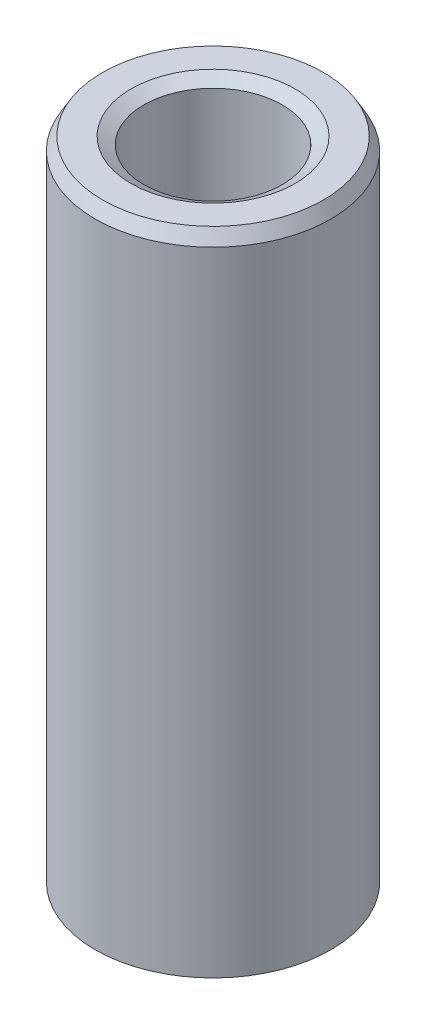
ISO-10303-21;
HEADER;
FILE_DESCRIPTION(('STEP AP214'),'2;1');
FILE_NAME('part.step','',(''),(''),'','','');
FILE_SCHEMA(('AUTOMOTIVE_DESIGN { 1 0 10303 214 1 1 1 1 }'));
ENDSEC;
DATA;
#1=APPLICATION_CONTEXT('core data for automotive mechanical design processes');
#2=APPLICATION_PROTOCOL_DEFINITION('international standard','automotive_design',2000,#1);
#3=PRODUCT_CONTEXT('',#1,'mechanical');
#4=PRODUCT('Part','Part','',(#3));
#5=PRODUCT_RELATED_PRODUCT_CATEGORY('part','',(#4));
#6=PRODUCT_DEFINITION_FORMATION('','',#4);
#7=PRODUCT_DEFINITION_CONTEXT('part definition',#1,'design');
#8=PRODUCT_DEFINITION('design','',#6,#7);
#9=PRODUCT_DEFINITION_SHAPE('','',#8);
#10=(LENGTH_UNIT() NAMED_UNIT(*) SI_UNIT(.MILLI.,.METRE.));
#11=(NAMED_UNIT(*) PLANE_ANGLE_UNIT() SI_UNIT($,.RADIAN.));
#12=(NAMED_UNIT(*) SI_UNIT($,.STERADIAN.) SOLID_ANGLE_UNIT());
#13=UNCERTAINTY_MEASURE_WITH_UNIT(LENGTH_MEASURE(1.E-05),#10,'distance_accuracy_value','');
#14=(GEOMETRIC_REPRESENTATION_CONTEXT(3) GLOBAL_UNCERTAINTY_ASSIGNED_CONTEXT((#13)) GLOBAL_UNIT_ASSIGNED_CONTEXT((#10,
#11,#12)) REPRESENTATION_CONTEXT('',''));
#15=CARTESIAN_POINT('',(0.,0.,0.));
#16=DIRECTION('',(0.,0.,1.));
#17=DIRECTION('',(1.,0.,0.));
#18=AXIS2_PLACEMENT_3D('',#15,#16,#17);
#19=CARTESIAN_POINT('',(0.,124.653891143306,0.));
#20=DIRECTION('',(0.,-1.,0.));
#21=DIRECTION('',(0.,0.,-1.));
#22=AXIS2_PLACEMENT_3D('',#19,#20,#21);
#23=CYLINDRICAL_SURFACE('',#22,22.5);
#24=CARTESIAN_POINT('',(0.,1.41458466481735,0.));
#25=DIRECTION('',(0.,1.,0.));
#26=DIRECTION('',(0.,0.,1.));
#27=AXIS2_PLACEMENT_3D('',#24,#25,#26);
#28=CIRCLE('',#27,22.5);
#29=CARTESIAN_POINT('',(0.,1.41458466481735,22.5));
#30=VERTEX_POINT('',#29);
#31=EDGE_CURVE('E10',#30,#30,#28,.T.);
#32=ORIENTED_EDGE('',*,*,#31,.T.);
#33=EDGE_LOOP('',(#32));
#34=FACE_BOUND('',#33,.T.);
#35=CARTESIAN_POINT('',(0.,122.203758632235,0.));
#36=DIRECTION('',(0.,1.,0.));
#37=DIRECTION('',(0.,0.,1.));
#38=AXIS2_PLACEMENT_3D('',#35,#36,#37);
#39=CIRCLE('',#38,22.5);
#40=CARTESIAN_POINT('',(0.,122.203758632235,22.5));
#41=VERTEX_POINT('',#40);
#42=EDGE_CURVE('E50',#41,#41,#39,.F.);
#43=ORIENTED_EDGE('',*,*,#42,.T.);
#44=EDGE_LOOP('',(#43));
#45=FACE_BOUND('',#44,.T.);
#46=ADVANCED_FACE('F39',(#34,#45),#23,.T.);
#47=CARTESIAN_POINT('',(0.,124.653891143306,0.));
#48=DIRECTION('',(0.,1.,0.));
#49=DIRECTION('',(0.,0.,1.));
#50=AXIS2_PLACEMENT_3D('',#47,#48,#49);
#51=PLANE('',#50);
#52=CARTESIAN_POINT('',(0.,124.653891143306,0.));
#53=DIRECTION('',(0.,1.,0.));
#54=DIRECTION('',(0.,0.,1.));
#55=AXIS2_PLACEMENT_3D('',#52,#53,#54);
#56=CIRCLE('',#55,15.6585667691788);
#57=CARTESIAN_POINT('',(0.,124.653891143306,15.6585667691788));
#58=VERTEX_POINT('',#57);
#59=EDGE_CURVE('E58',#58,#58,#56,.F.);
#60=ORIENTED_EDGE('',*,*,#59,.T.);
#61=EDGE_LOOP('',(#60));
#62=FACE_BOUND('',#61,.T.);
#63=CARTESIAN_POINT('',(0.,124.653891143306,0.));
#64=DIRECTION('',(0.,1.,0.));
#65=DIRECTION('',(0.,0.,1.));
#66=AXIS2_PLACEMENT_3D('',#63,#64,#65);
#67=CIRCLE('',#66,21.0854153351826);
#68=CARTESIAN_POINT('',(0.,124.653891143306,21.0854153351826));
#69=VERTEX_POINT('',#68);
#70=EDGE_CURVE('E61',#69,#69,#67,.T.);
#71=ORIENTED_EDGE('',*,*,#70,.T.);
#72=EDGE_LOOP('',(#71));
#73=FACE_BOUND('',#72,.T.);
#74=ADVANCED_FACE('F88',(#62,#73),#51,.T.);
#75=CARTESIAN_POINT('',(0.,0.,0.));
#76=DIRECTION('',(0.,1.,0.));
#77=DIRECTION('',(0.,0.,1.));
#78=AXIS2_PLACEMENT_3D('',#75,#76,#77);
#79=PLANE('',#78);
#80=CARTESIAN_POINT('',(0.,0.,0.));
#81=DIRECTION('',(0.,1.,0.));
#82=DIRECTION('',(0.,0.,1.));
#83=AXIS2_PLACEMENT_3D('',#80,#81,#82);
#84=CIRCLE('',#83,14.6230189229246);
#85=CARTESIAN_POINT('',(0.,0.,14.6230189229246));
#86=VERTEX_POINT('',#85);
#87=EDGE_CURVE('E51',#86,#86,#84,.T.);
#88=ORIENTED_EDGE('',*,*,#87,.T.);
#89=EDGE_LOOP('',(#88));
#90=FACE_BOUND('',#89,.T.);
#91=CARTESIAN_POINT('',(0.,0.,0.));
#92=DIRECTION('',(0.,1.,0.));
#93=DIRECTION('',(0.,0.,1.));
#94=AXIS2_PLACEMENT_3D('',#91,#92,#93);
#95=CIRCLE('',#94,20.0498674889285);
#96=CARTESIAN_POINT('',(0.,0.,20.0498674889285));
#97=VERTEX_POINT('',#96);
#98=EDGE_CURVE('E54',#97,#97,#95,.F.);
#99=ORIENTED_EDGE('',*,*,#98,.T.);
#100=EDGE_LOOP('',(#99));
#101=FACE_BOUND('',#100,.T.);
#102=ADVANCED_FACE('F83',(#90,#101),#79,.F.);
#103=CARTESIAN_POINT('',(0.,124.653891143306,0.));
#104=DIRECTION('',(0.,-1.,0.));
#105=DIRECTION('',(0.,0.,-1.));
#106=AXIS2_PLACEMENT_3D('',#103,#104,#105);
#107=CYLINDRICAL_SURFACE('',#106,13.2084342581073);
#108=CARTESIAN_POINT('',(0.,123.239306478489,0.));
#109=DIRECTION('',(0.,1.,0.));
#110=DIRECTION('',(0.,0.,1.));
#111=AXIS2_PLACEMENT_3D('',#108,#109,#110);
#112=CIRCLE('',#111,13.2084342581073);
#113=CARTESIAN_POINT('',(0.,123.239306478489,13.2084342581073));
#114=VERTEX_POINT('',#113);
#115=EDGE_CURVE('E67',#114,#114,#112,.T.);
#116=ORIENTED_EDGE('',*,*,#115,.T.);
#117=EDGE_LOOP('',(#116));
#118=FACE_BOUND('',#117,.T.);
#119=CARTESIAN_POINT('',(0.,2.45013251107146,0.));
#120=DIRECTION('',(0.,1.,0.));
#121=DIRECTION('',(0.,0.,1.));
#122=AXIS2_PLACEMENT_3D('',#119,#120,#121);
#123=CIRCLE('',#122,13.2084342581073);
#124=CARTESIAN_POINT('',(0.,2.45013251107146,13.2084342581073));
#125=VERTEX_POINT('',#124);
#126=EDGE_CURVE('E69',#125,#125,#123,.F.);
#127=ORIENTED_EDGE('',*,*,#126,.T.);
#128=EDGE_LOOP('',(#127));
#129=FACE_BOUND('',#128,.T.);
#130=ADVANCED_FACE('F71',(#118,#129),#107,.F.);
#131=CARTESIAN_POINT('',(0.,123.239306478489,0.));
#132=DIRECTION('',(0.,1.,0.));
#133=DIRECTION('',(0.,0.,1.));
#134=AXIS2_PLACEMENT_3D('',#131,#132,#133);
#135=CONICAL_SURFACE('',#134,13.2084342581073,1.0471975511966);
#136=ORIENTED_EDGE('',*,*,#59,.F.);
#137=EDGE_LOOP('',(#136));
#138=FACE_BOUND('',#137,.T.);
#139=ORIENTED_EDGE('',*,*,#115,.F.);
#140=EDGE_LOOP('',(#139));
#141=FACE_BOUND('',#140,.T.);
#142=ADVANCED_FACE('F77',(#138,#141),#135,.F.);
#143=CARTESIAN_POINT('',(0.,0.,0.));
#144=DIRECTION('',(0.,-1.,0.));
#145=DIRECTION('',(0.,0.,-1.));
#146=AXIS2_PLACEMENT_3D('',#143,#144,#145);
#147=CONICAL_SURFACE('',#146,14.6230189229246,0.523598775598295);
#148=ORIENTED_EDGE('',*,*,#126,.F.);
#149=EDGE_LOOP('',(#148));
#150=FACE_BOUND('',#149,.T.);
#151=ORIENTED_EDGE('',*,*,#87,.F.);
#152=EDGE_LOOP('',(#151));
#153=FACE_BOUND('',#152,.T.);
#154=ADVANCED_FACE('F73',(#150,#153),#147,.F.);
#155=CARTESIAN_POINT('',(0.,1.41458466481735,0.));
#156=DIRECTION('',(0.,1.,0.));
#157=DIRECTION('',(0.,0.,1.));
#158=AXIS2_PLACEMENT_3D('',#155,#156,#157);
#159=CONICAL_SURFACE('',#158,22.5,1.0471975511966);
#160=ORIENTED_EDGE('',*,*,#98,.F.);
#161=EDGE_LOOP('',(#160));
#162=FACE_BOUND('',#161,.T.);
#163=ORIENTED_EDGE('',*,*,#31,.F.);
#164=EDGE_LOOP('',(#163));
#165=FACE_BOUND('',#164,.T.);
#166=ADVANCED_FACE('F76',(#162,#165),#159,.T.);
#167=CARTESIAN_POINT('',(0.,124.653891143306,0.));
#168=DIRECTION('',(0.,-1.,0.));
#169=DIRECTION('',(0.,0.,-1.));
#170=AXIS2_PLACEMENT_3D('',#167,#168,#169);
#171=CONICAL_SURFACE('',#170,21.0854153351826,0.5235987755983);
#172=ORIENTED_EDGE('',*,*,#42,.F.);
#173=EDGE_LOOP('',(#172));
#174=FACE_BOUND('',#173,.T.);
#175=ORIENTED_EDGE('',*,*,#70,.F.);
#176=EDGE_LOOP('',(#175));
#177=FACE_BOUND('',#176,.T.);
#178=ADVANCED_FACE('F45',(#174,#177),#171,.T.);
#179=CLOSED_SHELL('',(#46,#74,#102,#130,#142,#154,#166,#178));
#180=MANIFOLD_SOLID_BREP('B2',#179);
#181=ADVANCED_BREP_SHAPE_REPRESENTATION('',(#18,#180),#14);
#182=SHAPE_DEFINITION_REPRESENTATION(#9,#181);
ENDSEC;
END-ISO-10303-21;
